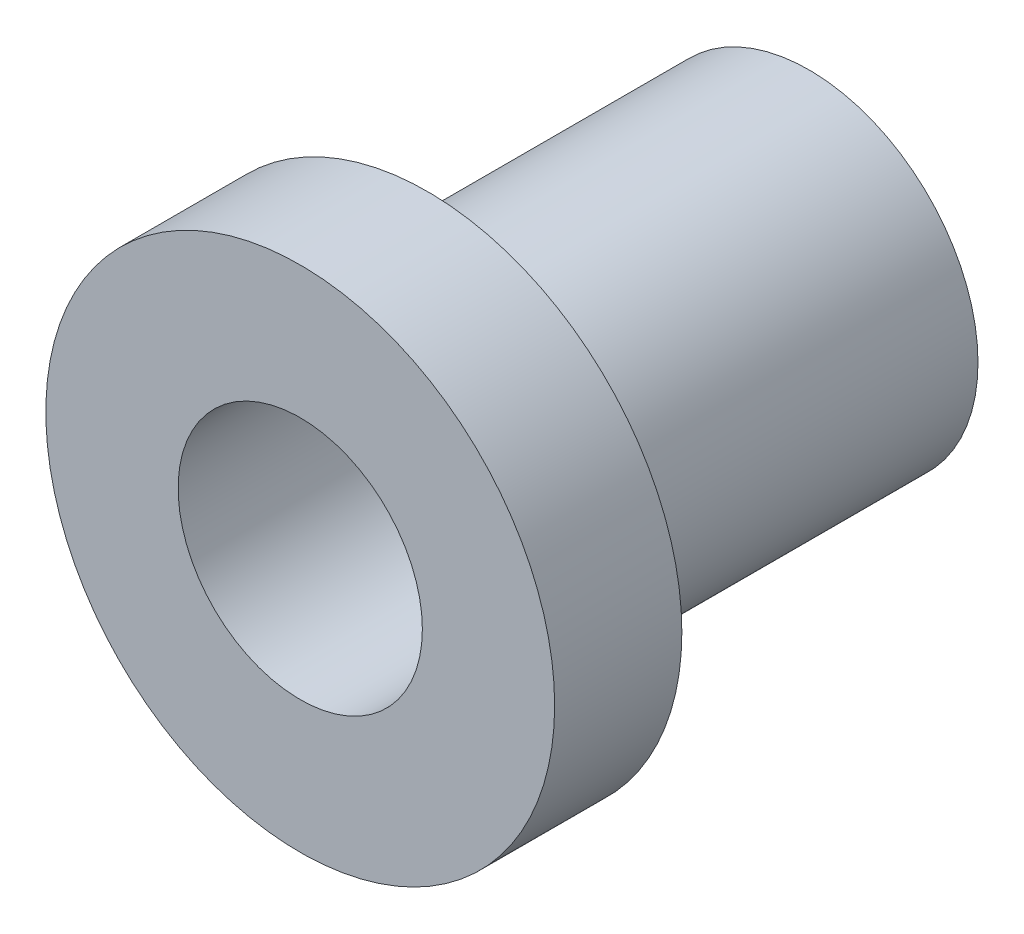
ISO-10303-21;
HEADER;
FILE_DESCRIPTION(('STEP AP214'),'2;1');
FILE_NAME('part.step','',(''),(''),'','','');
FILE_SCHEMA(('AUTOMOTIVE_DESIGN { 1 0 10303 214 1 1 1 1 }'));
ENDSEC;
DATA;
#1=APPLICATION_CONTEXT('core data for automotive mechanical design processes');
#2=APPLICATION_PROTOCOL_DEFINITION('international standard','automotive_design',2000,#1);
#3=PRODUCT_CONTEXT('',#1,'mechanical');
#4=PRODUCT('Part','Part','',(#3));
#5=PRODUCT_RELATED_PRODUCT_CATEGORY('part','',(#4));
#6=PRODUCT_DEFINITION_FORMATION('','',#4);
#7=PRODUCT_DEFINITION_CONTEXT('part definition',#1,'design');
#8=PRODUCT_DEFINITION('design','',#6,#7);
#9=PRODUCT_DEFINITION_SHAPE('','',#8);
#10=(LENGTH_UNIT() NAMED_UNIT(*) SI_UNIT(.MILLI.,.METRE.));
#11=(NAMED_UNIT(*) PLANE_ANGLE_UNIT() SI_UNIT($,.RADIAN.));
#12=(NAMED_UNIT(*) SI_UNIT($,.STERADIAN.) SOLID_ANGLE_UNIT());
#13=UNCERTAINTY_MEASURE_WITH_UNIT(LENGTH_MEASURE(1.E-05),#10,'distance_accuracy_value','');
#14=(GEOMETRIC_REPRESENTATION_CONTEXT(3) GLOBAL_UNCERTAINTY_ASSIGNED_CONTEXT((#13)) GLOBAL_UNIT_ASSIGNED_CONTEXT((#10,
#11,#12)) REPRESENTATION_CONTEXT('',''));
#15=CARTESIAN_POINT('',(0.,0.,0.));
#16=DIRECTION('',(0.,0.,1.));
#17=DIRECTION('',(1.,0.,0.));
#18=AXIS2_PLACEMENT_3D('',#15,#16,#17);
#19=CARTESIAN_POINT('',(0.,0.,9.525));
#20=DIRECTION('',(0.,0.,-1.));
#21=DIRECTION('',(-1.,0.,0.));
#22=AXIS2_PLACEMENT_3D('',#19,#20,#21);
#23=CYLINDRICAL_SURFACE('',#22,4.2164);
#24=CARTESIAN_POINT('',(0.,0.,9.525));
#25=DIRECTION('',(0.,0.,1.));
#26=DIRECTION('',(1.,0.,0.));
#27=AXIS2_PLACEMENT_3D('',#24,#25,#26);
#28=CIRCLE('',#27,4.2164);
#29=CARTESIAN_POINT('',(4.2164,0.,9.525));
#30=VERTEX_POINT('',#29);
#31=EDGE_CURVE('E10',#30,#30,#28,.T.);
#32=ORIENTED_EDGE('',*,*,#31,.F.);
#33=EDGE_LOOP('',(#32));
#34=FACE_BOUND('',#33,.T.);
#35=CARTESIAN_POINT('',(0.,0.,0.));
#36=DIRECTION('',(0.,0.,1.));
#37=DIRECTION('',(1.,0.,0.));
#38=AXIS2_PLACEMENT_3D('',#35,#36,#37);
#39=CIRCLE('',#38,4.2164);
#40=CARTESIAN_POINT('',(4.2164,0.,0.));
#41=VERTEX_POINT('',#40);
#42=EDGE_CURVE('E34',#41,#41,#39,.T.);
#43=ORIENTED_EDGE('',*,*,#42,.T.);
#44=EDGE_LOOP('',(#43));
#45=FACE_BOUND('',#44,.T.);
#46=ADVANCED_FACE('F31',(#34,#45),#23,.T.);
#47=CARTESIAN_POINT('',(0.,0.,0.));
#48=DIRECTION('',(0.,0.,1.));
#49=DIRECTION('',(1.,0.,0.));
#50=AXIS2_PLACEMENT_3D('',#47,#48,#49);
#51=PLANE('',#50);
#52=CARTESIAN_POINT('',(0.,0.,0.));
#53=DIRECTION('',(0.,0.,1.));
#54=DIRECTION('',(1.,0.,0.));
#55=AXIS2_PLACEMENT_3D('',#52,#53,#54);
#56=CIRCLE('',#55,3.048);
#57=CARTESIAN_POINT('',(3.048,0.,0.));
#58=VERTEX_POINT('',#57);
#59=EDGE_CURVE('E46',#58,#58,#56,.T.);
#60=ORIENTED_EDGE('',*,*,#59,.T.);
#61=EDGE_LOOP('',(#60));
#62=FACE_BOUND('',#61,.T.);
#63=ORIENTED_EDGE('',*,*,#42,.F.);
#64=EDGE_LOOP('',(#63));
#65=FACE_BOUND('',#64,.T.);
#66=ADVANCED_FACE('F55',(#62,#65),#51,.F.);
#67=CARTESIAN_POINT('',(0.,0.,9.525));
#68=DIRECTION('',(0.,0.,1.));
#69=DIRECTION('',(1.,0.,0.));
#70=AXIS2_PLACEMENT_3D('',#67,#68,#69);
#71=PLANE('',#70);
#72=CARTESIAN_POINT('',(0.,0.,9.525));
#73=DIRECTION('',(0.,0.,1.));
#74=DIRECTION('',(1.,0.,0.));
#75=AXIS2_PLACEMENT_3D('',#72,#73,#74);
#76=CIRCLE('',#75,6.35);
#77=CARTESIAN_POINT('',(6.35,0.,9.525));
#78=VERTEX_POINT('',#77);
#79=EDGE_CURVE('E43',#78,#78,#76,.T.);
#80=ORIENTED_EDGE('',*,*,#79,.F.);
#81=EDGE_LOOP('',(#80));
#82=FACE_BOUND('',#81,.T.);
#83=ORIENTED_EDGE('',*,*,#31,.T.);
#84=EDGE_LOOP('',(#83));
#85=FACE_BOUND('',#84,.T.);
#86=ADVANCED_FACE('F73',(#82,#85),#71,.F.);
#87=CARTESIAN_POINT('',(0.,0.,12.7));
#88=DIRECTION('',(0.,0.,-1.));
#89=DIRECTION('',(-1.,0.,0.));
#90=AXIS2_PLACEMENT_3D('',#87,#88,#89);
#91=CYLINDRICAL_SURFACE('',#90,6.35);
#92=CARTESIAN_POINT('',(0.,0.,12.7));
#93=DIRECTION('',(0.,0.,1.));
#94=DIRECTION('',(1.,0.,0.));
#95=AXIS2_PLACEMENT_3D('',#92,#93,#94);
#96=CIRCLE('',#95,6.35);
#97=CARTESIAN_POINT('',(6.35,0.,12.7));
#98=VERTEX_POINT('',#97);
#99=EDGE_CURVE('E41',#98,#98,#96,.T.);
#100=ORIENTED_EDGE('',*,*,#99,.F.);
#101=EDGE_LOOP('',(#100));
#102=FACE_BOUND('',#101,.T.);
#103=ORIENTED_EDGE('',*,*,#79,.T.);
#104=EDGE_LOOP('',(#103));
#105=FACE_BOUND('',#104,.T.);
#106=ADVANCED_FACE('F67',(#102,#105),#91,.T.);
#107=CARTESIAN_POINT('',(0.,0.,12.7));
#108=DIRECTION('',(0.,0.,1.));
#109=DIRECTION('',(1.,0.,0.));
#110=AXIS2_PLACEMENT_3D('',#107,#108,#109);
#111=PLANE('',#110);
#112=CARTESIAN_POINT('',(0.,0.,12.7));
#113=DIRECTION('',(0.,0.,1.));
#114=DIRECTION('',(1.,0.,0.));
#115=AXIS2_PLACEMENT_3D('',#112,#113,#114);
#116=CIRCLE('',#115,3.048);
#117=CARTESIAN_POINT('',(3.048,0.,12.7));
#118=VERTEX_POINT('',#117);
#119=EDGE_CURVE('E49',#118,#118,#116,.T.);
#120=ORIENTED_EDGE('',*,*,#119,.F.);
#121=EDGE_LOOP('',(#120));
#122=FACE_BOUND('',#121,.T.);
#123=ORIENTED_EDGE('',*,*,#99,.T.);
#124=EDGE_LOOP('',(#123));
#125=FACE_BOUND('',#124,.T.);
#126=ADVANCED_FACE('F61',(#122,#125),#111,.T.);
#127=CARTESIAN_POINT('',(0.,0.,0.));
#128=DIRECTION('',(0.,0.,1.));
#129=DIRECTION('',(1.,0.,0.));
#130=AXIS2_PLACEMENT_3D('',#127,#128,#129);
#131=CYLINDRICAL_SURFACE('',#130,3.048);
#132=ORIENTED_EDGE('',*,*,#59,.F.);
#133=EDGE_LOOP('',(#132));
#134=FACE_BOUND('',#133,.T.);
#135=ORIENTED_EDGE('',*,*,#119,.T.);
#136=EDGE_LOOP('',(#135));
#137=FACE_BOUND('',#136,.T.);
#138=ADVANCED_FACE('F58',(#134,#137),#131,.F.);
#139=CLOSED_SHELL('',(#46,#66,#86,#106,#126,#138));
#140=MANIFOLD_SOLID_BREP('B2',#139);
#141=ADVANCED_BREP_SHAPE_REPRESENTATION('',(#18,#140),#14);
#142=SHAPE_DEFINITION_REPRESENTATION(#9,#141);
ENDSEC;
END-ISO-10303-21;
